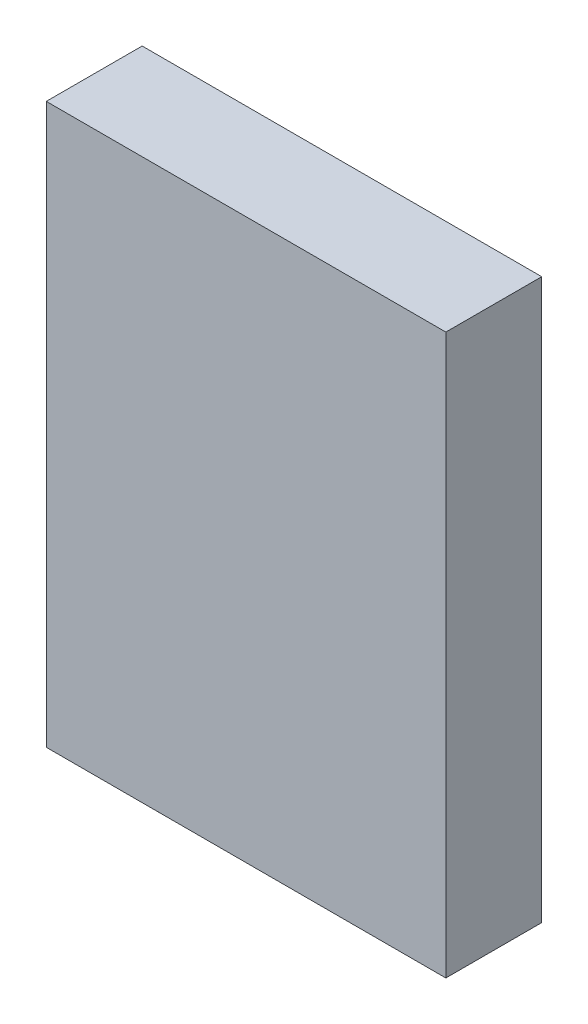
ISO-10303-21;
HEADER;
FILE_DESCRIPTION(('STEP AP214'),'2;1');
FILE_NAME('part.step','',(''),(''),'','','');
FILE_SCHEMA(('AUTOMOTIVE_DESIGN { 1 0 10303 214 1 1 1 1 }'));
ENDSEC;
DATA;
#1=APPLICATION_CONTEXT('core data for automotive mechanical design processes');
#2=APPLICATION_PROTOCOL_DEFINITION('international standard','automotive_design',2000,#1);
#3=PRODUCT_CONTEXT('',#1,'mechanical');
#4=PRODUCT('Part','Part','',(#3));
#5=PRODUCT_RELATED_PRODUCT_CATEGORY('part','',(#4));
#6=PRODUCT_DEFINITION_FORMATION('','',#4);
#7=PRODUCT_DEFINITION_CONTEXT('part definition',#1,'design');
#8=PRODUCT_DEFINITION('design','',#6,#7);
#9=PRODUCT_DEFINITION_SHAPE('','',#8);
#10=(LENGTH_UNIT() NAMED_UNIT(*) SI_UNIT(.MILLI.,.METRE.));
#11=(NAMED_UNIT(*) PLANE_ANGLE_UNIT() SI_UNIT($,.RADIAN.));
#12=(NAMED_UNIT(*) SI_UNIT($,.STERADIAN.) SOLID_ANGLE_UNIT());
#13=UNCERTAINTY_MEASURE_WITH_UNIT(LENGTH_MEASURE(1.E-05),#10,'distance_accuracy_value','');
#14=(GEOMETRIC_REPRESENTATION_CONTEXT(3) GLOBAL_UNCERTAINTY_ASSIGNED_CONTEXT((#13)) GLOBAL_UNIT_ASSIGNED_CONTEXT((#10,
#11,#12)) REPRESENTATION_CONTEXT('',''));
#15=CARTESIAN_POINT('',(0.,0.,0.));
#16=DIRECTION('',(0.,0.,1.));
#17=DIRECTION('',(1.,0.,0.));
#18=AXIS2_PLACEMENT_3D('',#15,#16,#17);
#19=CARTESIAN_POINT('',(-6.35162601626016,7.52032520325202,3.));
#20=DIRECTION('',(1.,0.,0.));
#21=DIRECTION('',(0.,1.,0.));
#22=AXIS2_PLACEMENT_3D('',#19,#20,#21);
#23=PLANE('',#22);
#24=DIRECTION('',(0.,-1.,0.));
#25=VECTOR('',#24,1.);
#26=CARTESIAN_POINT('',(-6.35162601626016,7.52032520325202,0.));
#27=LINE('',#26,#25);
#28=CARTESIAN_POINT('',(-6.35162601626016,7.52032520325202,0.));
#29=VERTEX_POINT('',#28);
#30=CARTESIAN_POINT('',(-6.35162601626016,-9.97967479674798,0.));
#31=VERTEX_POINT('',#30);
#32=EDGE_CURVE('E98',#29,#31,#27,.T.);
#33=ORIENTED_EDGE('',*,*,#32,.T.);
#34=DIRECTION('',(0.,0.,-1.));
#35=VECTOR('',#34,1.);
#36=CARTESIAN_POINT('',(-6.35162601626016,-9.97967479674798,3.));
#37=LINE('',#36,#35);
#38=CARTESIAN_POINT('',(-6.35162601626016,-9.97967479674798,3.));
#39=VERTEX_POINT('',#38);
#40=EDGE_CURVE('E11',#39,#31,#37,.T.);
#41=ORIENTED_EDGE('',*,*,#40,.F.);
#42=DIRECTION('',(0.,-1.,0.));
#43=VECTOR('',#42,1.);
#44=CARTESIAN_POINT('',(-6.35162601626016,7.52032520325202,3.));
#45=LINE('',#44,#43);
#46=CARTESIAN_POINT('',(-6.35162601626016,7.52032520325202,3.));
#47=VERTEX_POINT('',#46);
#48=EDGE_CURVE('E86',#47,#39,#45,.T.);
#49=ORIENTED_EDGE('',*,*,#48,.F.);
#50=DIRECTION('',(0.,0.,-1.));
#51=VECTOR('',#50,1.);
#52=CARTESIAN_POINT('',(-6.35162601626016,7.52032520325202,3.));
#53=LINE('',#52,#51);
#54=EDGE_CURVE('E94',#47,#29,#53,.T.);
#55=ORIENTED_EDGE('',*,*,#54,.T.);
#56=EDGE_LOOP('',(#33,#41,#49,#55));
#57=FACE_BOUND('',#56,.T.);
#58=ADVANCED_FACE('F35',(#57),#23,.F.);
#59=CARTESIAN_POINT('',(-6.35162601626016,-9.97967479674798,3.));
#60=DIRECTION('',(0.,1.,0.));
#61=DIRECTION('',(0.,0.,1.));
#62=AXIS2_PLACEMENT_3D('',#59,#60,#61);
#63=PLANE('',#62);
#64=DIRECTION('',(1.,0.,0.));
#65=VECTOR('',#64,1.);
#66=CARTESIAN_POINT('',(-6.35162601626016,-9.97967479674798,0.));
#67=LINE('',#66,#65);
#68=CARTESIAN_POINT('',(6.14837398373984,-9.97967479674798,0.));
#69=VERTEX_POINT('',#68);
#70=EDGE_CURVE('E90',#31,#69,#67,.T.);
#71=ORIENTED_EDGE('',*,*,#70,.T.);
#72=DIRECTION('',(0.,0.,-1.));
#73=VECTOR('',#72,1.);
#74=CARTESIAN_POINT('',(6.14837398373984,-9.97967479674798,3.));
#75=LINE('',#74,#73);
#76=CARTESIAN_POINT('',(6.14837398373984,-9.97967479674798,3.));
#77=VERTEX_POINT('',#76);
#78=EDGE_CURVE('E43',#77,#69,#75,.T.);
#79=ORIENTED_EDGE('',*,*,#78,.F.);
#80=DIRECTION('',(1.,0.,0.));
#81=VECTOR('',#80,1.);
#82=CARTESIAN_POINT('',(-6.35162601626016,-9.97967479674798,3.));
#83=LINE('',#82,#81);
#84=EDGE_CURVE('E81',#39,#77,#83,.T.);
#85=ORIENTED_EDGE('',*,*,#84,.F.);
#86=ORIENTED_EDGE('',*,*,#40,.T.);
#87=EDGE_LOOP('',(#71,#79,#85,#86));
#88=FACE_BOUND('',#87,.T.);
#89=ADVANCED_FACE('F89',(#88),#63,.F.);
#90=CARTESIAN_POINT('',(6.14837398373984,7.52032520325202,3.));
#91=DIRECTION('',(-1.,0.,0.));
#92=DIRECTION('',(0.,-1.,0.));
#93=AXIS2_PLACEMENT_3D('',#90,#91,#92);
#94=PLANE('',#93);
#95=DIRECTION('',(0.,1.,0.));
#96=VECTOR('',#95,1.);
#97=CARTESIAN_POINT('',(6.14837398373984,7.52032520325202,0.));
#98=LINE('',#97,#96);
#99=CARTESIAN_POINT('',(6.14837398373984,7.52032520325202,0.));
#100=VERTEX_POINT('',#99);
#101=EDGE_CURVE('E68',#69,#100,#98,.T.);
#102=ORIENTED_EDGE('',*,*,#101,.T.);
#103=DIRECTION('',(0.,0.,-1.));
#104=VECTOR('',#103,1.);
#105=CARTESIAN_POINT('',(6.14837398373984,7.52032520325202,3.));
#106=LINE('',#105,#104);
#107=CARTESIAN_POINT('',(6.14837398373984,7.52032520325202,3.));
#108=VERTEX_POINT('',#107);
#109=EDGE_CURVE('E91',#108,#100,#106,.T.);
#110=ORIENTED_EDGE('',*,*,#109,.F.);
#111=DIRECTION('',(0.,1.,0.));
#112=VECTOR('',#111,1.);
#113=CARTESIAN_POINT('',(6.14837398373984,7.52032520325202,3.));
#114=LINE('',#113,#112);
#115=EDGE_CURVE('E84',#77,#108,#114,.T.);
#116=ORIENTED_EDGE('',*,*,#115,.F.);
#117=ORIENTED_EDGE('',*,*,#78,.T.);
#118=EDGE_LOOP('',(#102,#110,#116,#117));
#119=FACE_BOUND('',#118,.T.);
#120=ADVANCED_FACE('F92',(#119),#94,.F.);
#121=CARTESIAN_POINT('',(-6.35162601626016,7.52032520325202,3.));
#122=DIRECTION('',(0.,-1.,0.));
#123=DIRECTION('',(0.,0.,-1.));
#124=AXIS2_PLACEMENT_3D('',#121,#122,#123);
#125=PLANE('',#124);
#126=DIRECTION('',(-1.,0.,0.));
#127=VECTOR('',#126,1.);
#128=CARTESIAN_POINT('',(-6.35162601626016,7.52032520325202,0.));
#129=LINE('',#128,#127);
#130=EDGE_CURVE('E74',#100,#29,#129,.T.);
#131=ORIENTED_EDGE('',*,*,#130,.T.);
#132=ORIENTED_EDGE('',*,*,#54,.F.);
#133=DIRECTION('',(-1.,0.,0.));
#134=VECTOR('',#133,1.);
#135=CARTESIAN_POINT('',(-6.35162601626016,7.52032520325202,3.));
#136=LINE('',#135,#134);
#137=EDGE_CURVE('E51',#108,#47,#136,.T.);
#138=ORIENTED_EDGE('',*,*,#137,.F.);
#139=ORIENTED_EDGE('',*,*,#109,.T.);
#140=EDGE_LOOP('',(#131,#132,#138,#139));
#141=FACE_BOUND('',#140,.T.);
#142=ADVANCED_FACE('F105',(#141),#125,.F.);
#143=CARTESIAN_POINT('',(0.,0.,3.));
#144=DIRECTION('',(0.,0.,1.));
#145=DIRECTION('',(1.,0.,0.));
#146=AXIS2_PLACEMENT_3D('',#143,#144,#145);
#147=PLANE('',#146);
#148=ORIENTED_EDGE('',*,*,#48,.T.);
#149=ORIENTED_EDGE('',*,*,#84,.T.);
#150=ORIENTED_EDGE('',*,*,#115,.T.);
#151=ORIENTED_EDGE('',*,*,#137,.T.);
#152=EDGE_LOOP('',(#148,#149,#150,#151));
#153=FACE_BOUND('',#152,.T.);
#154=ADVANCED_FACE('F82',(#153),#147,.T.);
#155=CARTESIAN_POINT('',(0.,0.,0.));
#156=DIRECTION('',(0.,0.,1.));
#157=DIRECTION('',(1.,0.,0.));
#158=AXIS2_PLACEMENT_3D('',#155,#156,#157);
#159=PLANE('',#158);
#160=ORIENTED_EDGE('',*,*,#32,.F.);
#161=ORIENTED_EDGE('',*,*,#130,.F.);
#162=ORIENTED_EDGE('',*,*,#101,.F.);
#163=ORIENTED_EDGE('',*,*,#70,.F.);
#164=EDGE_LOOP('',(#160,#161,#162,#163));
#165=FACE_BOUND('',#164,.T.);
#166=ADVANCED_FACE('F108',(#165),#159,.F.);
#167=CLOSED_SHELL('',(#58,#89,#120,#142,#154,#166));
#168=MANIFOLD_SOLID_BREP('B2',#167);
#169=ADVANCED_BREP_SHAPE_REPRESENTATION('',(#18,#168),#14);
#170=SHAPE_DEFINITION_REPRESENTATION(#9,#169);
ENDSEC;
END-ISO-10303-21;
